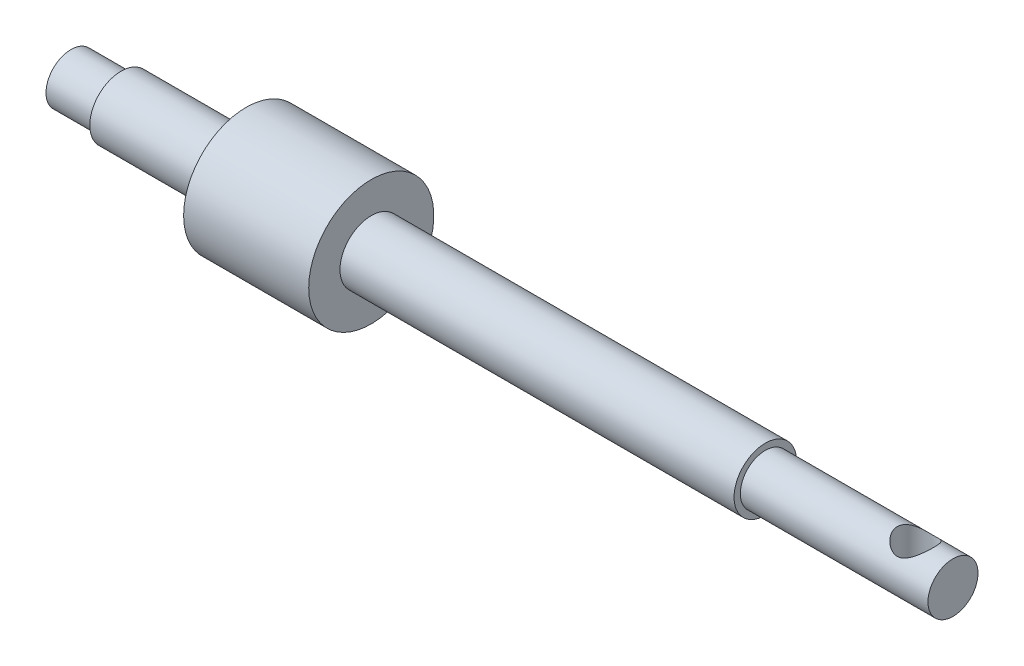
ISO-10303-21;
HEADER;
FILE_DESCRIPTION(('STEP AP214'),'2;1');
FILE_NAME('part.step','',(''),(''),'','','');
FILE_SCHEMA(('AUTOMOTIVE_DESIGN { 1 0 10303 214 1 1 1 1 }'));
ENDSEC;
DATA;
#1=APPLICATION_CONTEXT('core data for automotive mechanical design processes');
#2=APPLICATION_PROTOCOL_DEFINITION('international standard','automotive_design',2000,#1);
#3=PRODUCT_CONTEXT('',#1,'mechanical');
#4=PRODUCT('Part','Part','',(#3));
#5=PRODUCT_RELATED_PRODUCT_CATEGORY('part','',(#4));
#6=PRODUCT_DEFINITION_FORMATION('','',#4);
#7=PRODUCT_DEFINITION_CONTEXT('part definition',#1,'design');
#8=PRODUCT_DEFINITION('design','',#6,#7);
#9=PRODUCT_DEFINITION_SHAPE('','',#8);
#10=(LENGTH_UNIT() NAMED_UNIT(*) SI_UNIT(.MILLI.,.METRE.));
#11=(NAMED_UNIT(*) PLANE_ANGLE_UNIT() SI_UNIT($,.RADIAN.));
#12=(NAMED_UNIT(*) SI_UNIT($,.STERADIAN.) SOLID_ANGLE_UNIT());
#13=UNCERTAINTY_MEASURE_WITH_UNIT(LENGTH_MEASURE(1.E-05),#10,'distance_accuracy_value','');
#14=(GEOMETRIC_REPRESENTATION_CONTEXT(3) GLOBAL_UNCERTAINTY_ASSIGNED_CONTEXT((#13)) GLOBAL_UNIT_ASSIGNED_CONTEXT((#10,
#11,#12)) REPRESENTATION_CONTEXT('',''));
#15=CARTESIAN_POINT('',(0.,0.,0.));
#16=DIRECTION('',(0.,0.,1.));
#17=DIRECTION('',(1.,0.,0.));
#18=AXIS2_PLACEMENT_3D('',#15,#16,#17);
#19=CARTESIAN_POINT('',(-56.4792208121828,2.,0.));
#20=DIRECTION('',(1.,0.,0.));
#21=DIRECTION('',(0.,0.,-1.));
#22=AXIS2_PLACEMENT_3D('',#19,#20,#21);
#23=PLANE('',#22);
#24=CARTESIAN_POINT('',(-56.4792208121828,0.,0.));
#25=DIRECTION('',(-1.,0.,0.));
#26=DIRECTION('',(0.,0.,1.));
#27=AXIS2_PLACEMENT_3D('',#24,#25,#26);
#28=CIRCLE('',#27,2.);
#29=CARTESIAN_POINT('',(-56.4792208121828,0.,2.));
#30=VERTEX_POINT('',#29);
#31=EDGE_CURVE('E10',#30,#30,#28,.T.);
#32=ORIENTED_EDGE('',*,*,#31,.T.);
#33=EDGE_LOOP('',(#32));
#34=FACE_BOUND('',#33,.T.);
#35=ADVANCED_FACE('F36',(#34),#23,.F.);
#36=CARTESIAN_POINT('',(-56.4792208121828,0.,0.));
#37=DIRECTION('',(-1.,0.,0.));
#38=DIRECTION('',(0.,0.,1.));
#39=AXIS2_PLACEMENT_3D('',#36,#37,#38);
#40=CYLINDRICAL_SURFACE('',#39,2.);
#41=ORIENTED_EDGE('',*,*,#31,.F.);
#42=EDGE_LOOP('',(#41));
#43=FACE_BOUND('',#42,.T.);
#44=CARTESIAN_POINT('',(-52.4792208121828,0.,0.));
#45=DIRECTION('',(-1.,0.,0.));
#46=DIRECTION('',(0.,0.,1.));
#47=AXIS2_PLACEMENT_3D('',#44,#45,#46);
#48=CIRCLE('',#47,2.);
#49=CARTESIAN_POINT('',(-52.4792208121828,0.,2.));
#50=VERTEX_POINT('',#49);
#51=EDGE_CURVE('E49',#50,#50,#48,.T.);
#52=ORIENTED_EDGE('',*,*,#51,.T.);
#53=EDGE_LOOP('',(#52));
#54=FACE_BOUND('',#53,.T.);
#55=ADVANCED_FACE('F84',(#43,#54),#40,.T.);
#56=CARTESIAN_POINT('',(-52.4792208121828,2.5,0.));
#57=DIRECTION('',(1.,0.,0.));
#58=DIRECTION('',(0.,0.,-1.));
#59=AXIS2_PLACEMENT_3D('',#56,#57,#58);
#60=PLANE('',#59);
#61=ORIENTED_EDGE('',*,*,#51,.F.);
#62=EDGE_LOOP('',(#61));
#63=FACE_BOUND('',#62,.T.);
#64=CARTESIAN_POINT('',(-52.4792208121828,0.,0.));
#65=DIRECTION('',(-1.,0.,0.));
#66=DIRECTION('',(0.,0.,1.));
#67=AXIS2_PLACEMENT_3D('',#64,#65,#66);
#68=CIRCLE('',#67,2.5);
#69=CARTESIAN_POINT('',(-52.4792208121828,0.,2.5));
#70=VERTEX_POINT('',#69);
#71=EDGE_CURVE('E55',#70,#70,#68,.T.);
#72=ORIENTED_EDGE('',*,*,#71,.T.);
#73=EDGE_LOOP('',(#72));
#74=FACE_BOUND('',#73,.T.);
#75=ADVANCED_FACE('F88',(#63,#74),#60,.F.);
#76=CARTESIAN_POINT('',(-56.4792208121828,0.,0.));
#77=DIRECTION('',(-1.,0.,0.));
#78=DIRECTION('',(0.,0.,1.));
#79=AXIS2_PLACEMENT_3D('',#76,#77,#78);
#80=CYLINDRICAL_SURFACE('',#79,2.5);
#81=ORIENTED_EDGE('',*,*,#71,.F.);
#82=EDGE_LOOP('',(#81));
#83=FACE_BOUND('',#82,.T.);
#84=CARTESIAN_POINT('',(-42.4792208121828,0.,0.));
#85=DIRECTION('',(-1.,0.,0.));
#86=DIRECTION('',(0.,0.,1.));
#87=AXIS2_PLACEMENT_3D('',#84,#85,#86);
#88=CIRCLE('',#87,2.5);
#89=CARTESIAN_POINT('',(-42.4792208121828,0.,2.5));
#90=VERTEX_POINT('',#89);
#91=EDGE_CURVE('E148',#90,#90,#88,.T.);
#92=ORIENTED_EDGE('',*,*,#91,.T.);
#93=EDGE_LOOP('',(#92));
#94=FACE_BOUND('',#93,.T.);
#95=ADVANCED_FACE('F93',(#83,#94),#80,.T.);
#96=CARTESIAN_POINT('',(-42.4792208121828,2.5,0.));
#97=DIRECTION('',(1.,0.,0.));
#98=DIRECTION('',(0.,0.,-1.));
#99=AXIS2_PLACEMENT_3D('',#96,#97,#98);
#100=PLANE('',#99);
#101=ORIENTED_EDGE('',*,*,#91,.F.);
#102=EDGE_LOOP('',(#101));
#103=FACE_BOUND('',#102,.T.);
#104=CARTESIAN_POINT('',(-42.4792208121828,0.,0.));
#105=DIRECTION('',(-1.,0.,0.));
#106=DIRECTION('',(0.,0.,1.));
#107=AXIS2_PLACEMENT_3D('',#104,#105,#106);
#108=CIRCLE('',#107,5.);
#109=CARTESIAN_POINT('',(-42.4792208121828,0.,5.));
#110=VERTEX_POINT('',#109);
#111=EDGE_CURVE('E144',#110,#110,#108,.T.);
#112=ORIENTED_EDGE('',*,*,#111,.T.);
#113=EDGE_LOOP('',(#112));
#114=FACE_BOUND('',#113,.T.);
#115=ADVANCED_FACE('F100',(#103,#114),#100,.F.);
#116=CARTESIAN_POINT('',(-56.4792208121828,0.,0.));
#117=DIRECTION('',(-1.,0.,0.));
#118=DIRECTION('',(0.,0.,1.));
#119=AXIS2_PLACEMENT_3D('',#116,#117,#118);
#120=CYLINDRICAL_SURFACE('',#119,5.);
#121=ORIENTED_EDGE('',*,*,#111,.F.);
#122=EDGE_LOOP('',(#121));
#123=FACE_BOUND('',#122,.T.);
#124=CARTESIAN_POINT('',(-32.4792208121828,0.,0.));
#125=DIRECTION('',(-1.,0.,0.));
#126=DIRECTION('',(0.,0.,1.));
#127=AXIS2_PLACEMENT_3D('',#124,#125,#126);
#128=CIRCLE('',#127,5.);
#129=CARTESIAN_POINT('',(-32.4792208121828,0.,5.));
#130=VERTEX_POINT('',#129);
#131=EDGE_CURVE('E140',#130,#130,#128,.T.);
#132=ORIENTED_EDGE('',*,*,#131,.T.);
#133=EDGE_LOOP('',(#132));
#134=FACE_BOUND('',#133,.T.);
#135=ADVANCED_FACE('F104',(#123,#134),#120,.T.);
#136=CARTESIAN_POINT('',(-32.4792208121828,5.,0.));
#137=DIRECTION('',(-1.,0.,0.));
#138=DIRECTION('',(0.,0.,1.));
#139=AXIS2_PLACEMENT_3D('',#136,#137,#138);
#140=PLANE('',#139);
#141=ORIENTED_EDGE('',*,*,#131,.F.);
#142=EDGE_LOOP('',(#141));
#143=FACE_BOUND('',#142,.T.);
#144=CARTESIAN_POINT('',(-32.4792208121828,0.,0.));
#145=DIRECTION('',(-1.,0.,0.));
#146=DIRECTION('',(0.,0.,1.));
#147=AXIS2_PLACEMENT_3D('',#144,#145,#146);
#148=CIRCLE('',#147,2.5);
#149=CARTESIAN_POINT('',(-32.4792208121828,0.,2.5));
#150=VERTEX_POINT('',#149);
#151=EDGE_CURVE('E133',#150,#150,#148,.T.);
#152=ORIENTED_EDGE('',*,*,#151,.T.);
#153=EDGE_LOOP('',(#152));
#154=FACE_BOUND('',#153,.T.);
#155=ADVANCED_FACE('F108',(#143,#154),#140,.F.);
#156=CARTESIAN_POINT('',(-56.4792208121828,0.,0.));
#157=DIRECTION('',(-1.,0.,0.));
#158=DIRECTION('',(0.,0.,1.));
#159=AXIS2_PLACEMENT_3D('',#156,#157,#158);
#160=CYLINDRICAL_SURFACE('',#159,2.5);
#161=ORIENTED_EDGE('',*,*,#151,.F.);
#162=EDGE_LOOP('',(#161));
#163=FACE_BOUND('',#162,.T.);
#164=CARTESIAN_POINT('',(-0.979220812182782,0.,0.));
#165=DIRECTION('',(-1.,0.,0.));
#166=DIRECTION('',(0.,0.,1.));
#167=AXIS2_PLACEMENT_3D('',#164,#165,#166);
#168=CIRCLE('',#167,2.5);
#169=CARTESIAN_POINT('',(-0.979220812182782,0.,2.5));
#170=VERTEX_POINT('',#169);
#171=EDGE_CURVE('E123',#170,#170,#168,.T.);
#172=ORIENTED_EDGE('',*,*,#171,.T.);
#173=EDGE_LOOP('',(#172));
#174=FACE_BOUND('',#173,.T.);
#175=ADVANCED_FACE('F112',(#163,#174),#160,.T.);
#176=CARTESIAN_POINT('',(-0.979220812182782,2.5,0.));
#177=DIRECTION('',(-1.,0.,0.));
#178=DIRECTION('',(0.,0.,1.));
#179=AXIS2_PLACEMENT_3D('',#176,#177,#178);
#180=PLANE('',#179);
#181=ORIENTED_EDGE('',*,*,#171,.F.);
#182=EDGE_LOOP('',(#181));
#183=FACE_BOUND('',#182,.T.);
#184=CARTESIAN_POINT('',(-0.979220812182782,0.,0.));
#185=DIRECTION('',(-1.,0.,0.));
#186=DIRECTION('',(0.,0.,1.));
#187=AXIS2_PLACEMENT_3D('',#184,#185,#186);
#188=CIRCLE('',#187,2.);
#189=CARTESIAN_POINT('',(-0.979220812182782,0.,2.));
#190=VERTEX_POINT('',#189);
#191=EDGE_CURVE('E126',#190,#190,#188,.T.);
#192=ORIENTED_EDGE('',*,*,#191,.T.);
#193=EDGE_LOOP('',(#192));
#194=FACE_BOUND('',#193,.T.);
#195=ADVANCED_FACE('F80',(#183,#194),#180,.F.);
#196=CARTESIAN_POINT('',(-56.4792208121828,0.,0.));
#197=DIRECTION('',(-1.,0.,0.));
#198=DIRECTION('',(0.,0.,1.));
#199=AXIS2_PLACEMENT_3D('',#196,#197,#198);
#200=CYLINDRICAL_SURFACE('',#199,2.);
#201=CARTESIAN_POINT('',(11.0207791878172,-1.37749773139559,1.45));
#202=CARTESIAN_POINT('',(11.0893747724899,-1.37751434133449,1.44999150292991));
#203=CARTESIAN_POINT('',(11.158069316609,-1.38274018481781,1.44507418504036));
#204=CARTESIAN_POINT('',(11.2928207351022,-1.40249805687582,1.4258921692387));
#205=CARTESIAN_POINT('',(11.3588686025157,-1.41705939844791,1.41159802526948));
#206=CARTESIAN_POINT('',(11.485803958356,-1.45260819677381,1.37497839928941));
#207=CARTESIAN_POINT('',(11.5467458165523,-1.47351269349062,1.35275598521332));
#208=CARTESIAN_POINT('',(11.663856144065,-1.51925574130867,1.3011726301938));
#209=CARTESIAN_POINT('',(11.7200250076494,-1.54409396698212,1.27181227964702));
#210=CARTESIAN_POINT('',(11.8377630067741,-1.60056330196427,1.20027043499059));
#211=CARTESIAN_POINT('',(11.8983075977748,-1.63258456758535,1.15671051388949));
#212=CARTESIAN_POINT('',(12.0121541635264,-1.69649937277273,1.06076556082491));
#213=CARTESIAN_POINT('',(12.0654461967186,-1.72839267999596,1.0083686312383));
#214=CARTESIAN_POINT('',(12.1730899018685,-1.79533545964081,0.8846397243065));
#215=CARTESIAN_POINT('',(12.225821491664,-1.82988088871166,0.811597868016979));
#216=CARTESIAN_POINT('',(12.3177237832522,-1.89166965106413,0.654711020247266));
#217=CARTESIAN_POINT('',(12.356923831088,-1.91892875693141,0.570889955015703));
#218=CARTESIAN_POINT('',(12.4102292256353,-1.95648374629648,0.419985886470732));
#219=CARTESIAN_POINT('',(12.4283029568346,-1.96940024404832,0.354945636924479));
#220=CARTESIAN_POINT('',(12.4552723270776,-1.98876348564999,0.222063819109474));
#221=CARTESIAN_POINT('',(12.4641756451356,-1.99521564241101,0.154224644167957));
#222=CARTESIAN_POINT('',(12.4722935816093,-2.00109626184685,0.0175053463881974));
#223=CARTESIAN_POINT('',(12.471486302806,-2.00050885043478,-0.0513767791203717));
#224=CARTESIAN_POINT('',(12.4601821461353,-1.99232676303239,-0.187921706655852));
#225=CARTESIAN_POINT('',(12.4496827532333,-1.98473026823511,-0.255584187547141));
#226=CARTESIAN_POINT('',(12.4200406305887,-1.96349935569656,-0.385887629405395));
#227=CARTESIAN_POINT('',(12.4011519454731,-1.95004261584349,-0.448616641128725));
#228=CARTESIAN_POINT('',(12.3556862291664,-1.9181280612407,-0.569840827293332));
#229=CARTESIAN_POINT('',(12.3291076416923,-1.8996692342162,-0.628335141717412));
#230=CARTESIAN_POINT('',(12.2658683594752,-1.85665013295572,-0.746476961564343));
#231=CARTESIAN_POINT('',(12.228417099149,-1.83164054403913,-0.805534791696779));
#232=CARTESIAN_POINT('',(12.1462537122625,-1.77854139566257,-0.91684332477248));
#233=CARTESIAN_POINT('',(12.1015344831962,-1.75044883222538,-0.969087278026004));
#234=CARTESIAN_POINT('',(11.9965918158318,-1.68748881064998,-1.07558781889524));
#235=CARTESIAN_POINT('',(11.9350347835166,-1.65234240526664,-1.12836777461453));
#236=CARTESIAN_POINT('',(11.8034895652071,-1.58334817204238,-1.22329259339049));
#237=CARTESIAN_POINT('',(11.7335004584033,-1.54950048655892,-1.26543629337602));
#238=CARTESIAN_POINT('',(11.6016644922361,-1.49404964536535,-1.33011933389885));
#239=CARTESIAN_POINT('',(11.5413839659449,-1.47138747666461,-1.35493040090288));
#240=CARTESIAN_POINT('',(11.416332745882,-1.431946124208,-1.39655174266108));
#241=CARTESIAN_POINT('',(11.3515724822347,-1.41515379166048,-1.41337993016871));
#242=CARTESIAN_POINT('',(11.2293702780767,-1.39212665213502,-1.43603803509657));
#243=CARTESIAN_POINT('',(11.1724201878067,-1.38463062803819,-1.4431989281172));
#244=CARTESIAN_POINT('',(11.05759652379,-1.37680315294573,-1.45067105280695));
#245=CARTESIAN_POINT('',(10.9997237353519,-1.37646590411337,-1.4509878274783));
#246=CARTESIAN_POINT('',(10.8848666059674,-1.38299762658192,-1.44476095879249));
#247=CARTESIAN_POINT('',(10.8278811245351,-1.38985640964113,-1.43822701478638));
#248=CARTESIAN_POINT('',(10.7160923785719,-1.40971331817995,-1.41876604167968));
#249=CARTESIAN_POINT('',(10.6612926013847,-1.42272086013673,-1.4058292054773));
#250=CARTESIAN_POINT('',(10.5330845005323,-1.45951416657951,-1.36775981181006));
#251=CARTESIAN_POINT('',(10.4611635318887,-1.48553185530627,-1.33980763286327));
#252=CARTESIAN_POINT('',(10.3240991618038,-1.5423847156419,-1.27394852331001));
#253=CARTESIAN_POINT('',(10.2589696352134,-1.573229439514,-1.23602175038546));
#254=CARTESIAN_POINT('',(10.1339960050908,-1.6373555733851,-1.14980021878204));
#255=CARTESIAN_POINT('',(10.0743623334394,-1.67068187456647,-1.10123454591774));
#256=CARTESIAN_POINT('',(9.96318964253074,-1.73608222651492,-0.994942536189833));
#257=CARTESIAN_POINT('',(9.91164372946106,-1.7681573260579,-0.937224086254789));
#258=CARTESIAN_POINT('',(9.82001072753551,-1.82706899561259,-0.816161164785192));
#259=CARTESIAN_POINT('',(9.7794772193636,-1.8540880570051,-0.753246547298424));
#260=CARTESIAN_POINT('',(9.70795892214909,-1.9027111640418,-0.620237933275876));
#261=CARTESIAN_POINT('',(9.67697125800255,-1.92431683977196,-0.550146106928063));
#262=CARTESIAN_POINT('',(9.62590449432168,-1.96031730978648,-0.403592723695665));
#263=CARTESIAN_POINT('',(9.60591683071414,-1.97465158695882,-0.327083692771483));
#264=CARTESIAN_POINT('',(9.578686338209,-1.99425166985131,-0.170718464815721));
#265=CARTESIAN_POINT('',(9.57142990155121,-1.99952715792133,-0.0908659350977077));
#266=CARTESIAN_POINT('',(9.57029728870354,-2.00035030040113,0.0576711171526427));
#267=CARTESIAN_POINT('',(9.57467944209598,-1.99716420220334,0.126343462320557));
#268=CARTESIAN_POINT('',(9.59296142650172,-1.9839665212682,0.26172632874306));
#269=CARTESIAN_POINT('',(9.60686175186757,-1.97395458401215,0.3284367479119));
#270=CARTESIAN_POINT('',(9.64307005959797,-1.94818498247405,0.456943691257982));
#271=CARTESIAN_POINT('',(9.66521806299722,-1.93253682131066,0.518808203024628));
#272=CARTESIAN_POINT('',(9.71698645285402,-1.89658356743452,0.637840857855907));
#273=CARTESIAN_POINT('',(9.74660805273423,-1.87627771854234,0.695008236287962));
#274=CARTESIAN_POINT('',(9.81680036690165,-1.82928778105222,0.811260593538624));
#275=CARTESIAN_POINT('',(9.85830533012752,-1.80211394708821,0.869580671788722));
#276=CARTESIAN_POINT('',(9.94868373429017,-1.74518079760884,0.978851100046903));
#277=CARTESIAN_POINT('',(9.99756734398126,-1.71541793843671,1.0297910864305));
#278=CARTESIAN_POINT('',(10.1118050860591,-1.64958900891536,1.13280831552162));
#279=CARTESIAN_POINT('',(10.1785270700064,-1.61339206657855,1.18329086692478));
#280=CARTESIAN_POINT('',(10.3207744537446,-1.54390997706791,1.2726089310655));
#281=CARTESIAN_POINT('',(10.3962934601074,-1.51062274561769,1.3114528300054));
#282=CARTESIAN_POINT('',(10.5322193557367,-1.46063777197175,1.36656286569305));
#283=CARTESIAN_POINT('',(10.5905548125052,-1.44193859935035,1.38610946350805));
#284=CARTESIAN_POINT('',(10.7107165890568,-1.41078371094744,1.41781196263421));
#285=CARTESIAN_POINT('',(10.7725305147037,-1.39830721840599,1.42999248770166));
#286=CARTESIAN_POINT('',(10.8659302813644,-1.38584054779778,1.44203864338467));
#287=CARTESIAN_POINT('',(10.8967328159063,-1.38272853818924,1.44501614741371));
#288=CARTESIAN_POINT('',(10.9586098063076,-1.37855310356262,1.44899900357128));
#289=CARTESIAN_POINT('',(10.9896843296111,-1.37749020199414,1.45000385178129));
#290=CARTESIAN_POINT('',(11.0207791878172,-1.37749773139559,1.45));
#291=B_SPLINE_CURVE_WITH_KNOTS('',3,(#201,#202,#203,#204,#205,#206,#207,#208,#209,#210,#211,
#212,#213,#214,#215,#216,#217,#218,#219,#220,#221,#222,#223,#224,#225,#226,#227,#228,#229,#230,
#231,#232,#233,#234,#235,#236,#237,#238,#239,#240,#241,#242,#243,#244,#245,#246,#247,#248,#249,
#250,#251,#252,#253,#254,#255,#256,#257,#258,#259,#260,#261,#262,#263,#264,#265,#266,#267,#268,
#269,#270,#271,#272,#273,#274,#275,#276,#277,#278,#279,#280,#281,#282,#283,#284,#285,#286,#287,
#288,#289,#290),.UNSPECIFIED.,.T.,.F.,(4,2,2,2,2,2,2,2,2,2,2,2,2,2,2,2,2,2,2,2,2,2,2,2,2,2,2,2,
2,2,2,2,2,2,2,2,2,2,2,2,2,2,2,2,4),(0.,0.205628692041692,0.411906231340837,0.615594415194276,
0.819265757214617,1.06192572217712,1.30491503694098,1.59275561485131,1.87996796813944,
2.08528100224913,2.29042197359397,2.49602562064853,2.70168263538716,2.90149664337993,
3.10135111806587,3.32333821475095,3.54554356376703,3.80963045233319,4.07374620621584,
4.28010589468621,4.48600031708519,4.65887620869171,4.83161208410359,5.0041037272722,
5.17686039172695,5.41981926536455,5.66326515822973,5.91383481085221,6.16418970981833,
6.40193353816882,6.63960569050689,6.87922471609944,7.11858746872988,7.32421445671915,
7.52985212532431,7.73169287472135,7.93356641635253,8.16242104733885,8.39159399962356,
8.66395402403635,8.93611732553501,9.12838708360095,9.32001050567736,9.41319962746267,
9.50641255148173),.UNSPECIFIED.);
#292=CARTESIAN_POINT('',(11.0207791878172,-1.37749773139559,1.45));
#293=VERTEX_POINT('',#292);
#294=EDGE_CURVE('E39',#293,#293,#291,.T.);
#295=ORIENTED_EDGE('',*,*,#294,.T.);
#296=EDGE_LOOP('',(#295));
#297=FACE_BOUND('',#296,.T.);
#298=CARTESIAN_POINT('',(11.0207791878172,1.37749773139559,1.45));
#299=CARTESIAN_POINT('',(10.9521836031445,1.37751434133449,1.44999150292991));
#300=CARTESIAN_POINT('',(10.8834890590254,1.38274018481781,1.44507418504036));
#301=CARTESIAN_POINT('',(10.7487376405322,1.40249805687582,1.4258921692387));
#302=CARTESIAN_POINT('',(10.6826897731187,1.41705939844791,1.41159802526948));
#303=CARTESIAN_POINT('',(10.5557544172784,1.45260819677381,1.37497839928941));
#304=CARTESIAN_POINT('',(10.4948125590821,1.47351269349062,1.35275598521332));
#305=CARTESIAN_POINT('',(10.3777022315695,1.51925574130867,1.3011726301938));
#306=CARTESIAN_POINT('',(10.321533367985,1.54409396698212,1.27181227964702));
#307=CARTESIAN_POINT('',(10.2037953688604,1.60056330196427,1.20027043499059));
#308=CARTESIAN_POINT('',(10.1432507778596,1.63258456758535,1.15671051388949));
#309=CARTESIAN_POINT('',(10.0294042121081,1.69649937277273,1.06076556082491));
#310=CARTESIAN_POINT('',(9.97611217891579,1.72839267999596,1.0083686312383));
#311=CARTESIAN_POINT('',(9.86846847376591,1.79533545964081,0.8846397243065));
#312=CARTESIAN_POINT('',(9.81573688397041,1.82988088871166,0.811597868016979));
#313=CARTESIAN_POINT('',(9.72383459238219,1.89166965106413,0.654711020247266));
#314=CARTESIAN_POINT('',(9.68463454454639,1.91892875693141,0.570889955015703));
#315=CARTESIAN_POINT('',(9.63132914999909,1.95648374629648,0.419985886470732));
#316=CARTESIAN_POINT('',(9.61325541879979,1.96940024404832,0.354945636924479));
#317=CARTESIAN_POINT('',(9.58628604855682,1.98876348564999,0.222063819109474));
#318=CARTESIAN_POINT('',(9.57738273049883,1.99521564241101,0.154224644167957));
#319=CARTESIAN_POINT('',(9.56926479402513,2.00109626184685,0.0175053463881974));
#320=CARTESIAN_POINT('',(9.57007207282844,2.00050885043478,-0.0513767791203717));
#321=CARTESIAN_POINT('',(9.58137622949916,1.99232676303239,-0.187921706655852));
#322=CARTESIAN_POINT('',(9.59187562240113,1.98473026823511,-0.255584187547141));
#323=CARTESIAN_POINT('',(9.62151774504573,1.96349935569656,-0.385887629405395));
#324=CARTESIAN_POINT('',(9.6404064301613,1.95004261584349,-0.448616641128725));
#325=CARTESIAN_POINT('',(9.68587214646804,1.9181280612407,-0.569840827293332));
#326=CARTESIAN_POINT('',(9.71245073394218,1.8996692342162,-0.628335141717412));
#327=CARTESIAN_POINT('',(9.77569001615925,1.85665013295572,-0.746476961564342));
#328=CARTESIAN_POINT('',(9.81314127648538,1.83164054403913,-0.805534791696778));
#329=CARTESIAN_POINT('',(9.89530466337192,1.77854139566257,-0.916843324772479));
#330=CARTESIAN_POINT('',(9.94002389243827,1.75044883222538,-0.969087278026003));
#331=CARTESIAN_POINT('',(10.0449665598026,1.68748881064998,-1.07558781889524));
#332=CARTESIAN_POINT('',(10.1065235921178,1.65234240526664,-1.12836777461453));
#333=CARTESIAN_POINT('',(10.2380688104273,1.58334817204238,-1.22329259339049));
#334=CARTESIAN_POINT('',(10.3080579172311,1.54950048655892,-1.26543629337602));
#335=CARTESIAN_POINT('',(10.4398938833983,1.49404964536535,-1.33011933389886));
#336=CARTESIAN_POINT('',(10.5001744096895,1.47138747666461,-1.35493040090288));
#337=CARTESIAN_POINT('',(10.6252256297524,1.431946124208,-1.39655174266108));
#338=CARTESIAN_POINT('',(10.6899858933997,1.41515379166048,-1.41337993016871));
#339=CARTESIAN_POINT('',(10.8121880975577,1.39212665213502,-1.43603803509657));
#340=CARTESIAN_POINT('',(10.8691381878278,1.38463062803819,-1.4431989281172));
#341=CARTESIAN_POINT('',(10.9839618518444,1.37680315294573,-1.45067105280695));
#342=CARTESIAN_POINT('',(11.0418346402825,1.37646590411337,-1.4509878274783));
#343=CARTESIAN_POINT('',(11.1566917696671,1.38299762658192,-1.44476095879249));
#344=CARTESIAN_POINT('',(11.2136772510993,1.38985640964113,-1.43822701478638));
#345=CARTESIAN_POINT('',(11.3254659970626,1.40971331817995,-1.41876604167968));
#346=CARTESIAN_POINT('',(11.3802657742498,1.42272086013673,-1.4058292054773));
#347=CARTESIAN_POINT('',(11.5084738751022,1.45951416657951,-1.36775981181006));
#348=CARTESIAN_POINT('',(11.5803948437458,1.48553185530628,-1.33980763286327));
#349=CARTESIAN_POINT('',(11.7174592138306,1.5423847156419,-1.27394852331001));
#350=CARTESIAN_POINT('',(11.782588740421,1.573229439514,-1.23602175038546));
#351=CARTESIAN_POINT('',(11.9075623705437,1.6373555733851,-1.14980021878204));
#352=CARTESIAN_POINT('',(11.9671960421951,1.67068187456647,-1.10123454591774));
#353=CARTESIAN_POINT('',(12.0783687331037,1.73608222651492,-0.994942536189833));
#354=CARTESIAN_POINT('',(12.1299146461734,1.7681573260579,-0.937224086254789));
#355=CARTESIAN_POINT('',(12.2215476480989,1.82706899561259,-0.816161164785192));
#356=CARTESIAN_POINT('',(12.2620811562708,1.8540880570051,-0.753246547298424));
#357=CARTESIAN_POINT('',(12.3335994534853,1.9027111640418,-0.620237933275876));
#358=CARTESIAN_POINT('',(12.3645871176319,1.92431683977196,-0.550146106928063));
#359=CARTESIAN_POINT('',(12.4156538813127,1.96031730978648,-0.403592723695665));
#360=CARTESIAN_POINT('',(12.4356415449203,1.97465158695882,-0.327083692771483));
#361=CARTESIAN_POINT('',(12.4628720374254,1.99425166985131,-0.170718464815721));
#362=CARTESIAN_POINT('',(12.4701284740832,1.99952715792133,-0.0908659350977077));
#363=CARTESIAN_POINT('',(12.4712610869309,2.00035030040113,0.0576711171526427));
#364=CARTESIAN_POINT('',(12.4668789335384,1.99716420220334,0.126343462320557));
#365=CARTESIAN_POINT('',(12.4485969491327,1.9839665212682,0.26172632874306));
#366=CARTESIAN_POINT('',(12.4346966237669,1.97395458401215,0.3284367479119));
#367=CARTESIAN_POINT('',(12.3984883160365,1.94818498247405,0.456943691257982));
#368=CARTESIAN_POINT('',(12.3763403126372,1.93253682131066,0.518808203024628));
#369=CARTESIAN_POINT('',(12.3245719227804,1.89658356743452,0.637840857855907));
#370=CARTESIAN_POINT('',(12.2949503229002,1.87627771854234,0.695008236287962));
#371=CARTESIAN_POINT('',(12.2247580087328,1.82928778105222,0.811260593538624));
#372=CARTESIAN_POINT('',(12.1832530455069,1.80211394708821,0.869580671788722));
#373=CARTESIAN_POINT('',(12.0928746413443,1.74518079760884,0.978851100046903));
#374=CARTESIAN_POINT('',(12.0439910316532,1.71541793843671,1.0297910864305));
#375=CARTESIAN_POINT('',(11.9297532895753,1.64958900891536,1.13280831552162));
#376=CARTESIAN_POINT('',(11.863031305628,1.61339206657855,1.18329086692478));
#377=CARTESIAN_POINT('',(11.7207839218898,1.54390997706791,1.2726089310655));
#378=CARTESIAN_POINT('',(11.645264915527,1.51062274561769,1.3114528300054));
#379=CARTESIAN_POINT('',(11.5093390198977,1.46063777197175,1.36656286569305));
#380=CARTESIAN_POINT('',(11.4510035631292,1.44193859935035,1.38610946350805));
#381=CARTESIAN_POINT('',(11.3308417865776,1.41078371094744,1.41781196263421));
#382=CARTESIAN_POINT('',(11.2690278609308,1.39830721840599,1.42999248770166));
#383=CARTESIAN_POINT('',(11.17562809427,1.38584054779778,1.44203864338467));
#384=CARTESIAN_POINT('',(11.1448255597281,1.38272853818924,1.44501614741371));
#385=CARTESIAN_POINT('',(11.0829485693269,1.37855310356262,1.44899900357128));
#386=CARTESIAN_POINT('',(11.0518740460233,1.37749020199414,1.45000385178129));
#387=CARTESIAN_POINT('',(11.0207791878172,1.37749773139559,1.45));
#388=B_SPLINE_CURVE_WITH_KNOTS('',3,(#298,#299,#300,#301,#302,#303,#304,#305,#306,#307,#308,
#309,#310,#311,#312,#313,#314,#315,#316,#317,#318,#319,#320,#321,#322,#323,#324,#325,#326,#327,
#328,#329,#330,#331,#332,#333,#334,#335,#336,#337,#338,#339,#340,#341,#342,#343,#344,#345,#346,
#347,#348,#349,#350,#351,#352,#353,#354,#355,#356,#357,#358,#359,#360,#361,#362,#363,#364,#365,
#366,#367,#368,#369,#370,#371,#372,#373,#374,#375,#376,#377,#378,#379,#380,#381,#382,#383,#384,
#385,#386,#387),.UNSPECIFIED.,.T.,.F.,(4,2,2,2,2,2,2,2,2,2,2,2,2,2,2,2,2,2,2,2,2,2,2,2,2,2,2,2,
2,2,2,2,2,2,2,2,2,2,2,2,2,2,2,2,4),(0.,0.205628692041692,0.411906231340837,0.615594415194276,
0.819265757214617,1.06192572217712,1.30491503694098,1.59275561485131,1.87996796813944,
2.08528100224913,2.29042197359397,2.49602562064853,2.70168263538716,2.90149664337993,
3.10135111806587,3.32333821475095,3.54554356376703,3.80963045233319,4.07374620621584,
4.28010589468621,4.48600031708519,4.65887620869171,4.83161208410359,5.0041037272722,
5.17686039172695,5.41981926536454,5.66326515822973,5.91383481085221,6.16418970981833,
6.40193353816882,6.63960569050689,6.87922471609944,7.11858746872988,7.32421445671915,
7.52985212532431,7.73169287472135,7.93356641635253,8.16242104733885,8.39159399962356,
8.66395402403636,8.93611732553501,9.12838708360096,9.32001050567736,9.41319962746267,
9.50641255148173),.UNSPECIFIED.);
#389=CARTESIAN_POINT('',(11.0207791878172,1.37749773139559,1.45));
#390=VERTEX_POINT('',#389);
#391=EDGE_CURVE('E58',#390,#390,#388,.T.);
#392=ORIENTED_EDGE('',*,*,#391,.T.);
#393=EDGE_LOOP('',(#392));
#394=FACE_BOUND('',#393,.T.);
#395=ORIENTED_EDGE('',*,*,#191,.F.);
#396=EDGE_LOOP('',(#395));
#397=FACE_BOUND('',#396,.T.);
#398=CARTESIAN_POINT('',(14.0207791878172,0.,0.));
#399=DIRECTION('',(1.,0.,0.));
#400=DIRECTION('',(0.,0.,-1.));
#401=AXIS2_PLACEMENT_3D('',#398,#399,#400);
#402=CIRCLE('',#401,2.);
#403=CARTESIAN_POINT('',(14.0207791878172,0.,-2.));
#404=VERTEX_POINT('',#403);
#405=EDGE_CURVE('E129',#404,#404,#402,.T.);
#406=ORIENTED_EDGE('',*,*,#405,.F.);
#407=EDGE_LOOP('',(#406));
#408=FACE_BOUND('',#407,.T.);
#409=ADVANCED_FACE('F64',(#297,#394,#397,#408),#200,.T.);
#410=CARTESIAN_POINT('',(14.0207791878172,0.,0.));
#411=DIRECTION('',(1.,0.,0.));
#412=DIRECTION('',(0.,0.,-1.));
#413=AXIS2_PLACEMENT_3D('',#410,#411,#412);
#414=PLANE('',#413);
#415=ORIENTED_EDGE('',*,*,#405,.T.);
#416=EDGE_LOOP('',(#415));
#417=FACE_BOUND('',#416,.T.);
#418=ADVANCED_FACE('F71',(#417),#414,.T.);
#419=CARTESIAN_POINT('',(11.0207791878172,-5.,0.));
#420=DIRECTION('',(0.,1.,0.));
#421=DIRECTION('',(0.,0.,1.));
#422=AXIS2_PLACEMENT_3D('',#419,#420,#421);
#423=CYLINDRICAL_SURFACE('',#422,1.45);
#424=ORIENTED_EDGE('',*,*,#391,.F.);
#425=EDGE_LOOP('',(#424));
#426=FACE_BOUND('',#425,.T.);
#427=ORIENTED_EDGE('',*,*,#294,.F.);
#428=EDGE_LOOP('',(#427));
#429=FACE_BOUND('',#428,.T.);
#430=ADVANCED_FACE('F68',(#426,#429),#423,.F.);
#431=CLOSED_SHELL('',(#35,#55,#75,#95,#115,#135,#155,#175,#195,#409,#418,#430));
#432=MANIFOLD_SOLID_BREP('B2',#431);
#433=ADVANCED_BREP_SHAPE_REPRESENTATION('',(#18,#432),#14);
#434=SHAPE_DEFINITION_REPRESENTATION(#9,#433);
ENDSEC;
END-ISO-10303-21;
